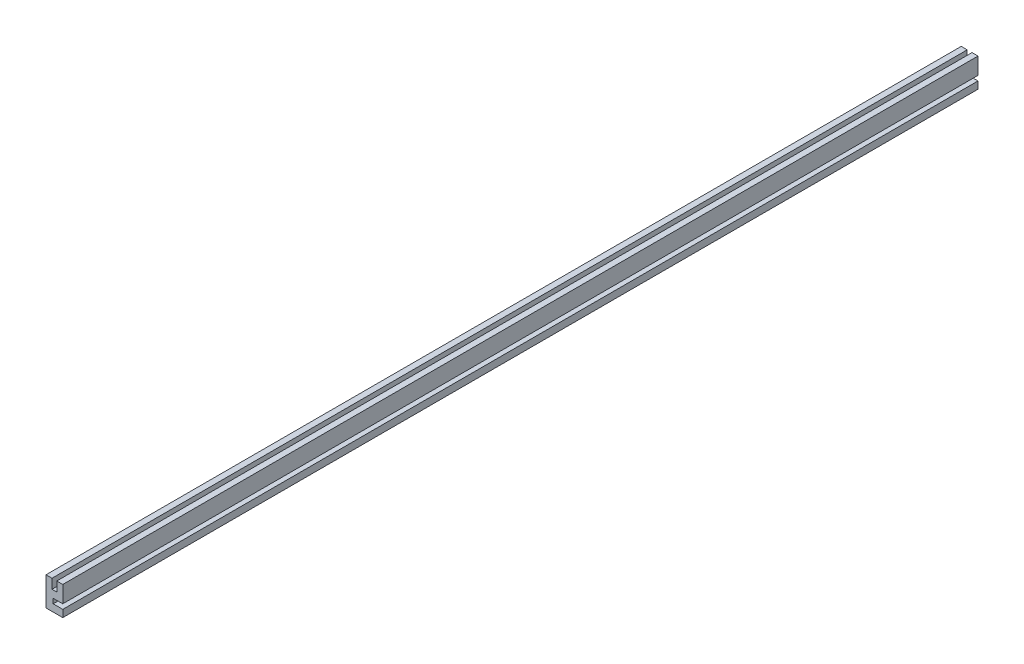
ISO-10303-21;
HEADER;
FILE_DESCRIPTION(('STEP AP214'),'2;1');
FILE_NAME('part.step','',(''),(''),'','','');
FILE_SCHEMA(('AUTOMOTIVE_DESIGN { 1 0 10303 214 1 1 1 1 }'));
ENDSEC;
DATA;
#1=APPLICATION_CONTEXT('core data for automotive mechanical design processes');
#2=APPLICATION_PROTOCOL_DEFINITION('international standard','automotive_design',2000,#1);
#3=PRODUCT_CONTEXT('',#1,'mechanical');
#4=PRODUCT('Part','Part','',(#3));
#5=PRODUCT_RELATED_PRODUCT_CATEGORY('part','',(#4));
#6=PRODUCT_DEFINITION_FORMATION('','',#4);
#7=PRODUCT_DEFINITION_CONTEXT('part definition',#1,'design');
#8=PRODUCT_DEFINITION('design','',#6,#7);
#9=PRODUCT_DEFINITION_SHAPE('','',#8);
#10=(LENGTH_UNIT() NAMED_UNIT(*) SI_UNIT(.MILLI.,.METRE.));
#11=(NAMED_UNIT(*) PLANE_ANGLE_UNIT() SI_UNIT($,.RADIAN.));
#12=(NAMED_UNIT(*) SI_UNIT($,.STERADIAN.) SOLID_ANGLE_UNIT());
#13=UNCERTAINTY_MEASURE_WITH_UNIT(LENGTH_MEASURE(1.E-05),#10,'distance_accuracy_value','');
#14=(GEOMETRIC_REPRESENTATION_CONTEXT(3) GLOBAL_UNCERTAINTY_ASSIGNED_CONTEXT((#13)) GLOBAL_UNIT_ASSIGNED_CONTEXT((#10,
#11,#12)) REPRESENTATION_CONTEXT('',''));
#15=CARTESIAN_POINT('',(0.,0.,0.));
#16=DIRECTION('',(0.,0.,1.));
#17=DIRECTION('',(1.,0.,0.));
#18=AXIS2_PLACEMENT_3D('',#15,#16,#17);
#19=CARTESIAN_POINT('',(5.55625,-9.525,303.2125));
#20=DIRECTION('',(-1.,0.,0.));
#21=DIRECTION('',(0.,0.,1.));
#22=AXIS2_PLACEMENT_3D('',#19,#20,#21);
#23=PLANE('',#22);
#24=DIRECTION('',(0.,1.,0.));
#25=VECTOR('',#24,1.);
#26=CARTESIAN_POINT('',(5.55625,-9.525,-303.2125));
#27=LINE('',#26,#25);
#28=CARTESIAN_POINT('',(5.55625,-9.525,-303.2125));
#29=VERTEX_POINT('',#28);
#30=CARTESIAN_POINT('',(5.55625,-4.7625,-303.2125));
#31=VERTEX_POINT('',#30);
#32=EDGE_CURVE('E150',#29,#31,#27,.T.);
#33=ORIENTED_EDGE('',*,*,#32,.T.);
#34=DIRECTION('',(0.,0.,1.));
#35=VECTOR('',#34,1.);
#36=CARTESIAN_POINT('',(5.55625,-4.7625,-303.2125));
#37=LINE('',#36,#35);
#38=CARTESIAN_POINT('',(5.55625,-4.7625,303.2125));
#39=VERTEX_POINT('',#38);
#40=EDGE_CURVE('E194',#31,#39,#37,.T.);
#41=ORIENTED_EDGE('',*,*,#40,.T.);
#42=DIRECTION('',(0.,1.,0.));
#43=VECTOR('',#42,1.);
#44=CARTESIAN_POINT('',(5.55625,-9.525,303.2125));
#45=LINE('',#44,#43);
#46=CARTESIAN_POINT('',(5.55625,-9.525,303.2125));
#47=VERTEX_POINT('',#46);
#48=EDGE_CURVE('E193',#47,#39,#45,.T.);
#49=ORIENTED_EDGE('',*,*,#48,.F.);
#50=DIRECTION('',(0.,0.,-1.));
#51=VECTOR('',#50,1.);
#52=CARTESIAN_POINT('',(5.55625,-9.525,303.2125));
#53=LINE('',#52,#51);
#54=EDGE_CURVE('E166',#47,#29,#53,.T.);
#55=ORIENTED_EDGE('',*,*,#54,.T.);
#56=EDGE_LOOP('',(#33,#41,#49,#55));
#57=FACE_BOUND('',#56,.T.);
#58=ADVANCED_FACE('F38',(#57),#23,.F.);
#59=CARTESIAN_POINT('',(-5.55625,9.525,303.2125));
#60=DIRECTION('',(0.,-1.,0.));
#61=DIRECTION('',(0.,0.,-1.));
#62=AXIS2_PLACEMENT_3D('',#59,#60,#61);
#63=PLANE('',#62);
#64=DIRECTION('',(-1.,0.,0.));
#65=VECTOR('',#64,1.);
#66=CARTESIAN_POINT('',(-5.55625,9.525,-303.2125));
#67=LINE('',#66,#65);
#68=CARTESIAN_POINT('',(5.55625,9.525,-303.2125));
#69=VERTEX_POINT('',#68);
#70=CARTESIAN_POINT('',(1.5875,9.525,-303.2125));
#71=VERTEX_POINT('',#70);
#72=EDGE_CURVE('E149',#69,#71,#67,.T.);
#73=ORIENTED_EDGE('',*,*,#72,.T.);
#74=DIRECTION('',(0.,0.,1.));
#75=VECTOR('',#74,1.);
#76=CARTESIAN_POINT('',(1.5875,9.525,-303.2125));
#77=LINE('',#76,#75);
#78=CARTESIAN_POINT('',(1.5875,9.525,303.2125));
#79=VERTEX_POINT('',#78);
#80=EDGE_CURVE('E202',#71,#79,#77,.T.);
#81=ORIENTED_EDGE('',*,*,#80,.T.);
#82=DIRECTION('',(-1.,0.,0.));
#83=VECTOR('',#82,1.);
#84=CARTESIAN_POINT('',(-5.55625,9.525,303.2125));
#85=LINE('',#84,#83);
#86=CARTESIAN_POINT('',(5.55625,9.525,303.2125));
#87=VERTEX_POINT('',#86);
#88=EDGE_CURVE('E199',#87,#79,#85,.T.);
#89=ORIENTED_EDGE('',*,*,#88,.F.);
#90=DIRECTION('',(0.,0.,-1.));
#91=VECTOR('',#90,1.);
#92=CARTESIAN_POINT('',(5.55625,9.525,303.2125));
#93=LINE('',#92,#91);
#94=EDGE_CURVE('E11',#87,#69,#93,.T.);
#95=ORIENTED_EDGE('',*,*,#94,.T.);
#96=EDGE_LOOP('',(#73,#81,#89,#95));
#97=FACE_BOUND('',#96,.T.);
#98=ADVANCED_FACE('F217',(#97),#63,.F.);
#99=CARTESIAN_POINT('',(5.55625,-1.5875,303.2125));
#100=VERTEX_POINT('',#99);
#101=EDGE_CURVE('E142',#100,#87,#45,.T.);
#102=ORIENTED_EDGE('',*,*,#101,.F.);
#103=DIRECTION('',(0.,0.,1.));
#104=VECTOR('',#103,1.);
#105=CARTESIAN_POINT('',(5.55625,-1.5875,-303.2125));
#106=LINE('',#105,#104);
#107=CARTESIAN_POINT('',(5.55625,-1.5875,-303.2125));
#108=VERTEX_POINT('',#107);
#109=EDGE_CURVE('E130',#108,#100,#106,.T.);
#110=ORIENTED_EDGE('',*,*,#109,.F.);
#111=EDGE_CURVE('E140',#108,#69,#27,.T.);
#112=ORIENTED_EDGE('',*,*,#111,.T.);
#113=ORIENTED_EDGE('',*,*,#94,.F.);
#114=EDGE_LOOP('',(#102,#110,#112,#113));
#115=FACE_BOUND('',#114,.T.);
#116=ADVANCED_FACE('F40',(#115),#23,.F.);
#117=CARTESIAN_POINT('',(-1.5875,9.525,303.2125));
#118=VERTEX_POINT('',#117);
#119=CARTESIAN_POINT('',(-5.55625,9.525,303.2125));
#120=VERTEX_POINT('',#119);
#121=EDGE_CURVE('E197',#118,#120,#85,.T.);
#122=ORIENTED_EDGE('',*,*,#121,.F.);
#123=DIRECTION('',(0.,0.,1.));
#124=VECTOR('',#123,1.);
#125=CARTESIAN_POINT('',(-1.5875,9.525,-303.2125));
#126=LINE('',#125,#124);
#127=CARTESIAN_POINT('',(-1.5875,9.525,-303.2125));
#128=VERTEX_POINT('',#127);
#129=EDGE_CURVE('E232',#128,#118,#126,.T.);
#130=ORIENTED_EDGE('',*,*,#129,.F.);
#131=CARTESIAN_POINT('',(-5.55625,9.525,-303.2125));
#132=VERTEX_POINT('',#131);
#133=EDGE_CURVE('E154',#128,#132,#67,.T.);
#134=ORIENTED_EDGE('',*,*,#133,.T.);
#135=DIRECTION('',(0.,0.,-1.));
#136=VECTOR('',#135,1.);
#137=CARTESIAN_POINT('',(-5.55625,9.525,303.2125));
#138=LINE('',#137,#136);
#139=EDGE_CURVE('E46',#120,#132,#138,.T.);
#140=ORIENTED_EDGE('',*,*,#139,.F.);
#141=EDGE_LOOP('',(#122,#130,#134,#140));
#142=FACE_BOUND('',#141,.T.);
#143=ADVANCED_FACE('F222',(#142),#63,.F.);
#144=CARTESIAN_POINT('',(-5.55625,-9.525,303.2125));
#145=DIRECTION('',(1.,0.,0.));
#146=DIRECTION('',(0.,0.,-1.));
#147=AXIS2_PLACEMENT_3D('',#144,#145,#146);
#148=PLANE('',#147);
#149=DIRECTION('',(0.,-1.,0.));
#150=VECTOR('',#149,1.);
#151=CARTESIAN_POINT('',(-5.55625,-9.525,-303.2125));
#152=LINE('',#151,#150);
#153=CARTESIAN_POINT('',(-5.55625,-9.525,-303.2125));
#154=VERTEX_POINT('',#153);
#155=EDGE_CURVE('E162',#132,#154,#152,.T.);
#156=ORIENTED_EDGE('',*,*,#155,.T.);
#157=DIRECTION('',(0.,0.,-1.));
#158=VECTOR('',#157,1.);
#159=CARTESIAN_POINT('',(-5.55625,-9.525,303.2125));
#160=LINE('',#159,#158);
#161=CARTESIAN_POINT('',(-5.55625,-9.525,303.2125));
#162=VERTEX_POINT('',#161);
#163=EDGE_CURVE('E169',#162,#154,#160,.T.);
#164=ORIENTED_EDGE('',*,*,#163,.F.);
#165=DIRECTION('',(0.,-1.,0.));
#166=VECTOR('',#165,1.);
#167=CARTESIAN_POINT('',(-5.55625,-9.525,303.2125));
#168=LINE('',#167,#166);
#169=EDGE_CURVE('E178',#120,#162,#168,.T.);
#170=ORIENTED_EDGE('',*,*,#169,.F.);
#171=ORIENTED_EDGE('',*,*,#139,.T.);
#172=EDGE_LOOP('',(#156,#164,#170,#171));
#173=FACE_BOUND('',#172,.T.);
#174=ADVANCED_FACE('F176',(#173),#148,.F.);
#175=CARTESIAN_POINT('',(-5.55625,-9.525,303.2125));
#176=DIRECTION('',(0.,1.,0.));
#177=DIRECTION('',(0.,0.,1.));
#178=AXIS2_PLACEMENT_3D('',#175,#176,#177);
#179=PLANE('',#178);
#180=DIRECTION('',(1.,0.,0.));
#181=VECTOR('',#180,1.);
#182=CARTESIAN_POINT('',(-5.55625,-9.525,-303.2125));
#183=LINE('',#182,#181);
#184=EDGE_CURVE('E164',#154,#29,#183,.T.);
#185=ORIENTED_EDGE('',*,*,#184,.T.);
#186=ORIENTED_EDGE('',*,*,#54,.F.);
#187=DIRECTION('',(1.,0.,0.));
#188=VECTOR('',#187,1.);
#189=CARTESIAN_POINT('',(-5.55625,-9.525,303.2125));
#190=LINE('',#189,#188);
#191=EDGE_CURVE('E159',#162,#47,#190,.T.);
#192=ORIENTED_EDGE('',*,*,#191,.F.);
#193=ORIENTED_EDGE('',*,*,#163,.T.);
#194=EDGE_LOOP('',(#185,#186,#192,#193));
#195=FACE_BOUND('',#194,.T.);
#196=ADVANCED_FACE('F187',(#195),#179,.F.);
#197=CARTESIAN_POINT('',(0.,0.,303.2125));
#198=DIRECTION('',(0.,0.,-1.));
#199=DIRECTION('',(-1.,0.,0.));
#200=AXIS2_PLACEMENT_3D('',#197,#198,#199);
#201=PLANE('',#200);
#202=ORIENTED_EDGE('',*,*,#48,.T.);
#203=DIRECTION('',(1.,0.,0.));
#204=VECTOR('',#203,1.);
#205=CARTESIAN_POINT('',(5.55625,-4.7625,303.2125));
#206=LINE('',#205,#204);
#207=CARTESIAN_POINT('',(-0.793750000000002,-4.7625,303.2125));
#208=VERTEX_POINT('',#207);
#209=EDGE_CURVE('E135',#208,#39,#206,.T.);
#210=ORIENTED_EDGE('',*,*,#209,.F.);
#211=DIRECTION('',(0.,-1.,0.));
#212=VECTOR('',#211,1.);
#213=CARTESIAN_POINT('',(-0.793750000000002,-4.7625,303.2125));
#214=LINE('',#213,#212);
#215=CARTESIAN_POINT('',(-0.793750000000002,-1.5875,303.2125));
#216=VERTEX_POINT('',#215);
#217=EDGE_CURVE('E259',#216,#208,#214,.T.);
#218=ORIENTED_EDGE('',*,*,#217,.F.);
#219=DIRECTION('',(-1.,0.,0.));
#220=VECTOR('',#219,1.);
#221=CARTESIAN_POINT('',(5.55625,-1.5875,303.2125));
#222=LINE('',#221,#220);
#223=EDGE_CURVE('E262',#100,#216,#222,.T.);
#224=ORIENTED_EDGE('',*,*,#223,.F.);
#225=ORIENTED_EDGE('',*,*,#101,.T.);
#226=ORIENTED_EDGE('',*,*,#88,.T.);
#227=DIRECTION('',(0.,1.,0.));
#228=VECTOR('',#227,1.);
#229=CARTESIAN_POINT('',(1.5875,3.175,303.2125));
#230=LINE('',#229,#228);
#231=CARTESIAN_POINT('',(1.5875,3.175,303.2125));
#232=VERTEX_POINT('',#231);
#233=EDGE_CURVE('E241',#232,#79,#230,.T.);
#234=ORIENTED_EDGE('',*,*,#233,.F.);
#235=DIRECTION('',(1.,0.,0.));
#236=VECTOR('',#235,1.);
#237=CARTESIAN_POINT('',(-1.5875,3.175,303.2125));
#238=LINE('',#237,#236);
#239=CARTESIAN_POINT('',(-1.5875,3.175,303.2125));
#240=VERTEX_POINT('',#239);
#241=EDGE_CURVE('E239',#240,#232,#238,.T.);
#242=ORIENTED_EDGE('',*,*,#241,.F.);
#243=DIRECTION('',(0.,-1.,0.));
#244=VECTOR('',#243,1.);
#245=CARTESIAN_POINT('',(-1.5875,3.175,303.2125));
#246=LINE('',#245,#244);
#247=EDGE_CURVE('E236',#118,#240,#246,.T.);
#248=ORIENTED_EDGE('',*,*,#247,.F.);
#249=ORIENTED_EDGE('',*,*,#121,.T.);
#250=ORIENTED_EDGE('',*,*,#169,.T.);
#251=ORIENTED_EDGE('',*,*,#191,.T.);
#252=EDGE_LOOP('',(#202,#210,#218,#224,#225,#226,#234,#242,#248,#249,#250,#251));
#253=FACE_BOUND('',#252,.T.);
#254=ADVANCED_FACE('F205',(#253),#201,.F.);
#255=CARTESIAN_POINT('',(0.,0.,-303.2125));
#256=DIRECTION('',(0.,0.,-1.));
#257=DIRECTION('',(-1.,0.,0.));
#258=AXIS2_PLACEMENT_3D('',#255,#256,#257);
#259=PLANE('',#258);
#260=DIRECTION('',(1.,0.,0.));
#261=VECTOR('',#260,1.);
#262=CARTESIAN_POINT('',(5.55625,-4.7625,-303.2125));
#263=LINE('',#262,#261);
#264=CARTESIAN_POINT('',(-0.793750000000002,-4.7625,-303.2125));
#265=VERTEX_POINT('',#264);
#266=EDGE_CURVE('E143',#265,#31,#263,.T.);
#267=ORIENTED_EDGE('',*,*,#266,.T.);
#268=ORIENTED_EDGE('',*,*,#32,.F.);
#269=ORIENTED_EDGE('',*,*,#184,.F.);
#270=ORIENTED_EDGE('',*,*,#155,.F.);
#271=ORIENTED_EDGE('',*,*,#133,.F.);
#272=DIRECTION('',(0.,-1.,0.));
#273=VECTOR('',#272,1.);
#274=CARTESIAN_POINT('',(-1.5875,3.175,-303.2125));
#275=LINE('',#274,#273);
#276=CARTESIAN_POINT('',(-1.5875,3.175,-303.2125));
#277=VERTEX_POINT('',#276);
#278=EDGE_CURVE('E250',#128,#277,#275,.T.);
#279=ORIENTED_EDGE('',*,*,#278,.T.);
#280=DIRECTION('',(1.,0.,0.));
#281=VECTOR('',#280,1.);
#282=CARTESIAN_POINT('',(-1.5875,3.175,-303.2125));
#283=LINE('',#282,#281);
#284=CARTESIAN_POINT('',(1.5875,3.175,-303.2125));
#285=VERTEX_POINT('',#284);
#286=EDGE_CURVE('E61',#277,#285,#283,.T.);
#287=ORIENTED_EDGE('',*,*,#286,.T.);
#288=DIRECTION('',(0.,1.,0.));
#289=VECTOR('',#288,1.);
#290=CARTESIAN_POINT('',(1.5875,3.175,-303.2125));
#291=LINE('',#290,#289);
#292=EDGE_CURVE('E243',#285,#71,#291,.T.);
#293=ORIENTED_EDGE('',*,*,#292,.T.);
#294=ORIENTED_EDGE('',*,*,#72,.F.);
#295=ORIENTED_EDGE('',*,*,#111,.F.);
#296=DIRECTION('',(-1.,0.,0.));
#297=VECTOR('',#296,1.);
#298=CARTESIAN_POINT('',(5.55625,-1.5875,-303.2125));
#299=LINE('',#298,#297);
#300=CARTESIAN_POINT('',(-0.793750000000002,-1.5875,-303.2125));
#301=VERTEX_POINT('',#300);
#302=EDGE_CURVE('E126',#108,#301,#299,.T.);
#303=ORIENTED_EDGE('',*,*,#302,.T.);
#304=DIRECTION('',(0.,-1.,0.));
#305=VECTOR('',#304,1.);
#306=CARTESIAN_POINT('',(-0.793750000000002,-4.7625,-303.2125));
#307=LINE('',#306,#305);
#308=EDGE_CURVE('E53',#301,#265,#307,.T.);
#309=ORIENTED_EDGE('',*,*,#308,.T.);
#310=EDGE_LOOP('',(#267,#268,#269,#270,#271,#279,#287,#293,#294,#295,#303,#309));
#311=FACE_BOUND('',#310,.T.);
#312=ADVANCED_FACE('F146',(#311),#259,.T.);
#313=CARTESIAN_POINT('',(1.5875,3.175,-303.2125));
#314=DIRECTION('',(1.,0.,0.));
#315=DIRECTION('',(0.,0.,-1.));
#316=AXIS2_PLACEMENT_3D('',#313,#314,#315);
#317=PLANE('',#316);
#318=ORIENTED_EDGE('',*,*,#233,.T.);
#319=ORIENTED_EDGE('',*,*,#80,.F.);
#320=ORIENTED_EDGE('',*,*,#292,.F.);
#321=DIRECTION('',(0.,0.,1.));
#322=VECTOR('',#321,1.);
#323=CARTESIAN_POINT('',(1.5875,3.175,-303.2125));
#324=LINE('',#323,#322);
#325=EDGE_CURVE('E151',#285,#232,#324,.T.);
#326=ORIENTED_EDGE('',*,*,#325,.T.);
#327=EDGE_LOOP('',(#318,#319,#320,#326));
#328=FACE_BOUND('',#327,.T.);
#329=ADVANCED_FACE('F212',(#328),#317,.F.);
#330=CARTESIAN_POINT('',(-1.5875,3.175,-303.2125));
#331=DIRECTION('',(0.,-1.,0.));
#332=DIRECTION('',(0.,0.,-1.));
#333=AXIS2_PLACEMENT_3D('',#330,#331,#332);
#334=PLANE('',#333);
#335=ORIENTED_EDGE('',*,*,#241,.T.);
#336=ORIENTED_EDGE('',*,*,#325,.F.);
#337=ORIENTED_EDGE('',*,*,#286,.F.);
#338=DIRECTION('',(0.,0.,1.));
#339=VECTOR('',#338,1.);
#340=CARTESIAN_POINT('',(-1.5875,3.175,-303.2125));
#341=LINE('',#340,#339);
#342=EDGE_CURVE('E155',#277,#240,#341,.T.);
#343=ORIENTED_EDGE('',*,*,#342,.T.);
#344=EDGE_LOOP('',(#335,#336,#337,#343));
#345=FACE_BOUND('',#344,.T.);
#346=ADVANCED_FACE('F280',(#345),#334,.F.);
#347=CARTESIAN_POINT('',(-1.5875,3.175,-303.2125));
#348=DIRECTION('',(-1.,0.,0.));
#349=DIRECTION('',(0.,0.,1.));
#350=AXIS2_PLACEMENT_3D('',#347,#348,#349);
#351=PLANE('',#350);
#352=ORIENTED_EDGE('',*,*,#247,.T.);
#353=ORIENTED_EDGE('',*,*,#342,.F.);
#354=ORIENTED_EDGE('',*,*,#278,.F.);
#355=ORIENTED_EDGE('',*,*,#129,.T.);
#356=EDGE_LOOP('',(#352,#353,#354,#355));
#357=FACE_BOUND('',#356,.T.);
#358=ADVANCED_FACE('F277',(#357),#351,.F.);
#359=CARTESIAN_POINT('',(5.55625,-4.7625,-303.2125));
#360=DIRECTION('',(0.,-1.,0.));
#361=DIRECTION('',(1.,0.,0.));
#362=AXIS2_PLACEMENT_3D('',#359,#360,#361);
#363=PLANE('',#362);
#364=ORIENTED_EDGE('',*,*,#209,.T.);
#365=ORIENTED_EDGE('',*,*,#40,.F.);
#366=ORIENTED_EDGE('',*,*,#266,.F.);
#367=DIRECTION('',(0.,0.,1.));
#368=VECTOR('',#367,1.);
#369=CARTESIAN_POINT('',(-0.793750000000002,-4.7625,-303.2125));
#370=LINE('',#369,#368);
#371=EDGE_CURVE('E255',#265,#208,#370,.T.);
#372=ORIENTED_EDGE('',*,*,#371,.T.);
#373=EDGE_LOOP('',(#364,#365,#366,#372));
#374=FACE_BOUND('',#373,.T.);
#375=ADVANCED_FACE('F267',(#374),#363,.F.);
#376=CARTESIAN_POINT('',(-0.793750000000002,-4.7625,-303.2125));
#377=DIRECTION('',(-1.,0.,0.));
#378=DIRECTION('',(0.,0.,1.));
#379=AXIS2_PLACEMENT_3D('',#376,#377,#378);
#380=PLANE('',#379);
#381=ORIENTED_EDGE('',*,*,#217,.T.);
#382=ORIENTED_EDGE('',*,*,#371,.F.);
#383=ORIENTED_EDGE('',*,*,#308,.F.);
#384=DIRECTION('',(0.,0.,1.));
#385=VECTOR('',#384,1.);
#386=CARTESIAN_POINT('',(-0.793750000000002,-1.5875,-303.2125));
#387=LINE('',#386,#385);
#388=EDGE_CURVE('E132',#301,#216,#387,.T.);
#389=ORIENTED_EDGE('',*,*,#388,.T.);
#390=EDGE_LOOP('',(#381,#382,#383,#389));
#391=FACE_BOUND('',#390,.T.);
#392=ADVANCED_FACE('F269',(#391),#380,.F.);
#393=CARTESIAN_POINT('',(5.55625,-1.5875,-303.2125));
#394=DIRECTION('',(0.,1.,0.));
#395=DIRECTION('',(-1.,0.,0.));
#396=AXIS2_PLACEMENT_3D('',#393,#394,#395);
#397=PLANE('',#396);
#398=ORIENTED_EDGE('',*,*,#223,.T.);
#399=ORIENTED_EDGE('',*,*,#388,.F.);
#400=ORIENTED_EDGE('',*,*,#302,.F.);
#401=ORIENTED_EDGE('',*,*,#109,.T.);
#402=EDGE_LOOP('',(#398,#399,#400,#401));
#403=FACE_BOUND('',#402,.T.);
#404=ADVANCED_FACE('F129',(#403),#397,.F.);
#405=CLOSED_SHELL('',(#58,#98,#116,#143,#174,#196,#254,#312,#329,#346,#358,#375,#392,#404));
#406=MANIFOLD_SOLID_BREP('B2',#405);
#407=ADVANCED_BREP_SHAPE_REPRESENTATION('',(#18,#406),#14);
#408=SHAPE_DEFINITION_REPRESENTATION(#9,#407);
ENDSEC;
END-ISO-10303-21;
